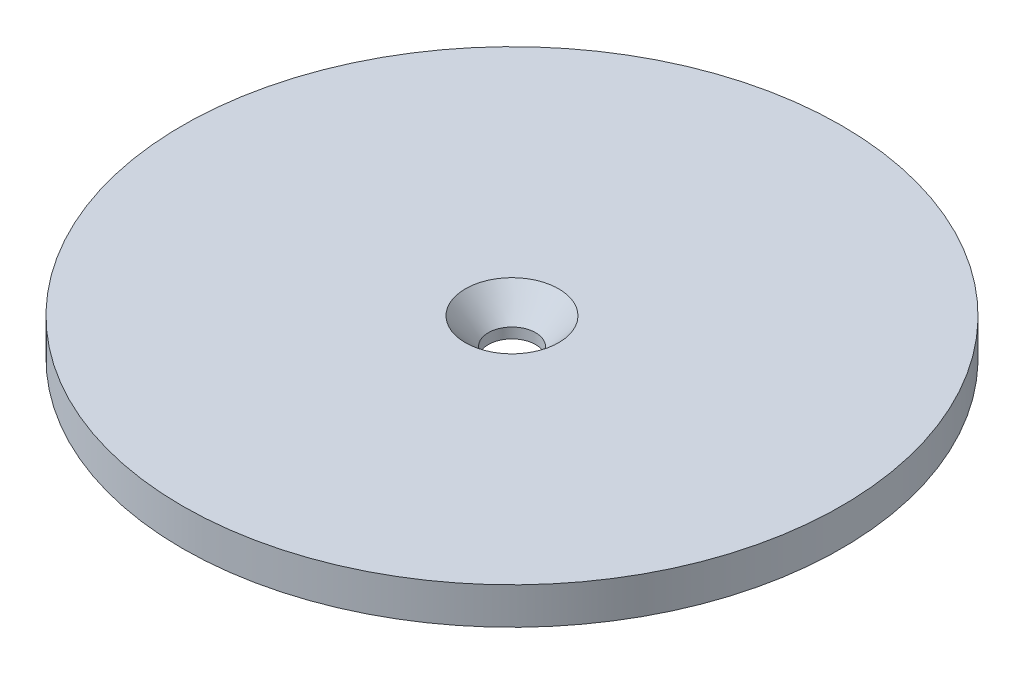
ISO-10303-21;
HEADER;
FILE_DESCRIPTION(('STEP AP214'),'2;1');
FILE_NAME('part.step','',(''),(''),'','','');
FILE_SCHEMA(('AUTOMOTIVE_DESIGN { 1 0 10303 214 1 1 1 1 }'));
ENDSEC;
DATA;
#1=APPLICATION_CONTEXT('core data for automotive mechanical design processes');
#2=APPLICATION_PROTOCOL_DEFINITION('international standard','automotive_design',2000,#1);
#3=PRODUCT_CONTEXT('',#1,'mechanical');
#4=PRODUCT('Part','Part','',(#3));
#5=PRODUCT_RELATED_PRODUCT_CATEGORY('part','',(#4));
#6=PRODUCT_DEFINITION_FORMATION('','',#4);
#7=PRODUCT_DEFINITION_CONTEXT('part definition',#1,'design');
#8=PRODUCT_DEFINITION('design','',#6,#7);
#9=PRODUCT_DEFINITION_SHAPE('','',#8);
#10=(LENGTH_UNIT() NAMED_UNIT(*) SI_UNIT(.MILLI.,.METRE.));
#11=(NAMED_UNIT(*) PLANE_ANGLE_UNIT() SI_UNIT($,.RADIAN.));
#12=(NAMED_UNIT(*) SI_UNIT($,.STERADIAN.) SOLID_ANGLE_UNIT());
#13=UNCERTAINTY_MEASURE_WITH_UNIT(LENGTH_MEASURE(1.E-05),#10,'distance_accuracy_value','');
#14=(GEOMETRIC_REPRESENTATION_CONTEXT(3) GLOBAL_UNCERTAINTY_ASSIGNED_CONTEXT((#13)) GLOBAL_UNIT_ASSIGNED_CONTEXT((#10,
#11,#12)) REPRESENTATION_CONTEXT('',''));
#15=CARTESIAN_POINT('',(0.,0.,0.));
#16=DIRECTION('',(0.,0.,1.));
#17=DIRECTION('',(1.,0.,0.));
#18=AXIS2_PLACEMENT_3D('',#15,#16,#17);
#19=CARTESIAN_POINT('',(0.,25.4,0.));
#20=DIRECTION('',(0.,-1.,0.));
#21=DIRECTION('',(0.,0.,-1.));
#22=AXIS2_PLACEMENT_3D('',#19,#20,#21);
#23=CYLINDRICAL_SURFACE('',#22,45.466);
#24=CARTESIAN_POINT('',(0.,25.4,0.));
#25=DIRECTION('',(0.,1.,0.));
#26=DIRECTION('',(0.,0.,1.));
#27=AXIS2_PLACEMENT_3D('',#24,#25,#26);
#28=CIRCLE('',#27,45.466);
#29=CARTESIAN_POINT('',(0.,25.4,45.466));
#30=VERTEX_POINT('',#29);
#31=EDGE_CURVE('E10',#30,#30,#28,.T.);
#32=ORIENTED_EDGE('',*,*,#31,.F.);
#33=EDGE_LOOP('',(#32));
#34=FACE_BOUND('',#33,.T.);
#35=CARTESIAN_POINT('',(0.,20.322357612504,0.));
#36=DIRECTION('',(0.,-1.,0.));
#37=DIRECTION('',(0.,0.,-1.));
#38=AXIS2_PLACEMENT_3D('',#35,#36,#37);
#39=CIRCLE('',#38,45.466);
#40=CARTESIAN_POINT('',(0.,20.322357612504,-45.466));
#41=VERTEX_POINT('',#40);
#42=EDGE_CURVE('E53',#41,#41,#39,.T.);
#43=ORIENTED_EDGE('',*,*,#42,.F.);
#44=EDGE_LOOP('',(#43));
#45=FACE_BOUND('',#44,.T.);
#46=ADVANCED_FACE('F37',(#34,#45),#23,.T.);
#47=CARTESIAN_POINT('',(0.,25.4,0.));
#48=DIRECTION('',(0.,1.,0.));
#49=DIRECTION('',(0.,0.,1.));
#50=AXIS2_PLACEMENT_3D('',#47,#48,#49);
#51=CYLINDRICAL_SURFACE('',#50,3.26389999999999);
#52=CARTESIAN_POINT('',(0.,21.7475803070733,0.));
#53=DIRECTION('',(0.,1.,0.));
#54=DIRECTION('',(0.,0.,1.));
#55=AXIS2_PLACEMENT_3D('',#52,#53,#54);
#56=CIRCLE('',#55,3.2639);
#57=CARTESIAN_POINT('',(0.,21.7475803070733,3.2639));
#58=VERTEX_POINT('',#57);
#59=EDGE_CURVE('E44',#58,#58,#56,.T.);
#60=ORIENTED_EDGE('',*,*,#59,.T.);
#61=EDGE_LOOP('',(#60));
#62=FACE_BOUND('',#61,.T.);
#63=CARTESIAN_POINT('',(0.,20.322357612504,0.));
#64=DIRECTION('',(0.,-1.,0.));
#65=DIRECTION('',(0.,0.,-1.));
#66=AXIS2_PLACEMENT_3D('',#63,#64,#65);
#67=CIRCLE('',#66,3.26389999999999);
#68=CARTESIAN_POINT('',(0.,20.322357612504,-3.26389999999999));
#69=VERTEX_POINT('',#68);
#70=EDGE_CURVE('E40',#69,#69,#67,.F.);
#71=ORIENTED_EDGE('',*,*,#70,.F.);
#72=EDGE_LOOP('',(#71));
#73=FACE_BOUND('',#72,.T.);
#74=ADVANCED_FACE('F62',(#62,#73),#51,.F.);
#75=CARTESIAN_POINT('',(0.,25.4,0.));
#76=DIRECTION('',(0.,1.,0.));
#77=DIRECTION('',(0.,0.,1.));
#78=AXIS2_PLACEMENT_3D('',#75,#76,#77);
#79=PLANE('',#78);
#80=CARTESIAN_POINT('',(0.,25.4,0.));
#81=DIRECTION('',(0.,1.,0.));
#82=DIRECTION('',(0.,0.,1.));
#83=AXIS2_PLACEMENT_3D('',#80,#81,#82);
#84=CIRCLE('',#83,6.4389);
#85=CARTESIAN_POINT('',(0.,25.4,6.4389));
#86=VERTEX_POINT('',#85);
#87=EDGE_CURVE('E48',#86,#86,#84,.T.);
#88=ORIENTED_EDGE('',*,*,#87,.F.);
#89=EDGE_LOOP('',(#88));
#90=FACE_BOUND('',#89,.T.);
#91=ORIENTED_EDGE('',*,*,#31,.T.);
#92=EDGE_LOOP('',(#91));
#93=FACE_BOUND('',#92,.T.);
#94=ADVANCED_FACE('F64',(#90,#93),#79,.T.);
#95=CARTESIAN_POINT('',(0.,25.4,0.));
#96=DIRECTION('',(0.,1.,0.));
#97=DIRECTION('',(0.,0.,1.));
#98=AXIS2_PLACEMENT_3D('',#95,#96,#97);
#99=CONICAL_SURFACE('',#98,6.4389,0.715584993317675);
#100=ORIENTED_EDGE('',*,*,#59,.F.);
#101=EDGE_LOOP('',(#100));
#102=FACE_BOUND('',#101,.T.);
#103=ORIENTED_EDGE('',*,*,#87,.T.);
#104=EDGE_LOOP('',(#103));
#105=FACE_BOUND('',#104,.T.);
#106=ADVANCED_FACE('F72',(#102,#105),#99,.F.);
#107=CARTESIAN_POINT('',(0.,20.322357612504,0.));
#108=DIRECTION('',(0.,-1.,0.));
#109=DIRECTION('',(0.,0.,-1.));
#110=AXIS2_PLACEMENT_3D('',#107,#108,#109);
#111=PLANE('',#110);
#112=ORIENTED_EDGE('',*,*,#70,.T.);
#113=EDGE_LOOP('',(#112));
#114=FACE_BOUND('',#113,.T.);
#115=ORIENTED_EDGE('',*,*,#42,.T.);
#116=EDGE_LOOP('',(#115));
#117=FACE_BOUND('',#116,.T.);
#118=ADVANCED_FACE('F60',(#114,#117),#111,.T.);
#119=CLOSED_SHELL('',(#46,#74,#94,#106,#118));
#120=MANIFOLD_SOLID_BREP('B2',#119);
#121=ADVANCED_BREP_SHAPE_REPRESENTATION('',(#18,#120),#14);
#122=SHAPE_DEFINITION_REPRESENTATION(#9,#121);
ENDSEC;
END-ISO-10303-21;
